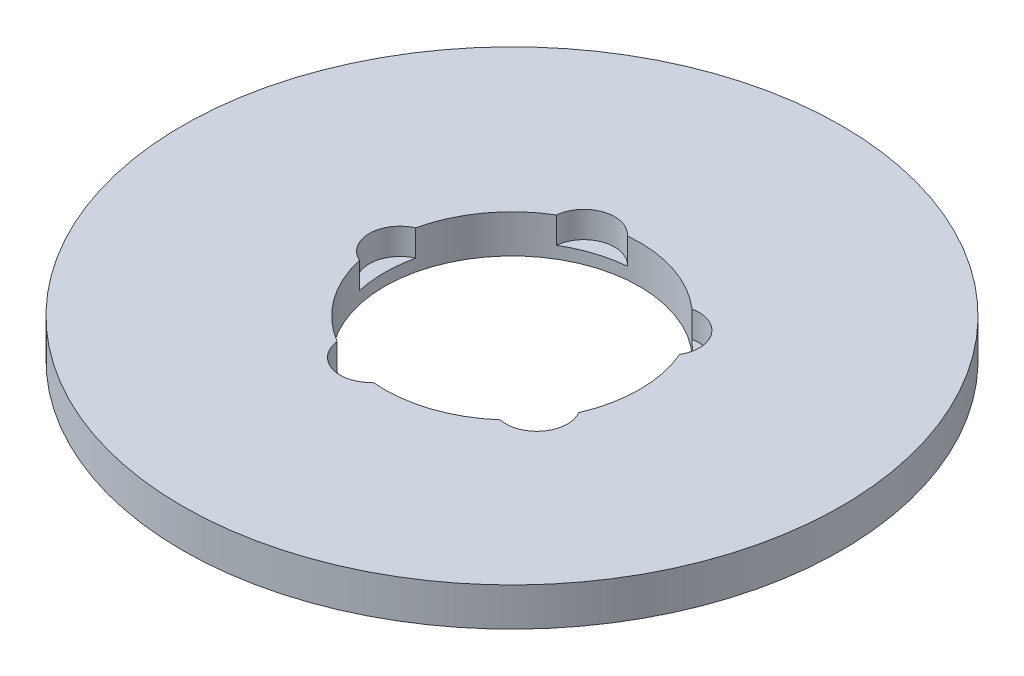
ISO-10303-21;
HEADER;
FILE_DESCRIPTION(('STEP AP214'),'2;1');
FILE_NAME('part.step','',(''),(''),'','','');
FILE_SCHEMA(('AUTOMOTIVE_DESIGN { 1 0 10303 214 1 1 1 1 }'));
ENDSEC;
DATA;
#1=APPLICATION_CONTEXT('core data for automotive mechanical design processes');
#2=APPLICATION_PROTOCOL_DEFINITION('international standard','automotive_design',2000,#1);
#3=PRODUCT_CONTEXT('',#1,'mechanical');
#4=PRODUCT('Part','Part','',(#3));
#5=PRODUCT_RELATED_PRODUCT_CATEGORY('part','',(#4));
#6=PRODUCT_DEFINITION_FORMATION('','',#4);
#7=PRODUCT_DEFINITION_CONTEXT('part definition',#1,'design');
#8=PRODUCT_DEFINITION('design','',#6,#7);
#9=PRODUCT_DEFINITION_SHAPE('','',#8);
#10=(LENGTH_UNIT() NAMED_UNIT(*) SI_UNIT(.MILLI.,.METRE.));
#11=(NAMED_UNIT(*) PLANE_ANGLE_UNIT() SI_UNIT($,.RADIAN.));
#12=(NAMED_UNIT(*) SI_UNIT($,.STERADIAN.) SOLID_ANGLE_UNIT());
#13=UNCERTAINTY_MEASURE_WITH_UNIT(LENGTH_MEASURE(1.E-05),#10,'distance_accuracy_value','');
#14=(GEOMETRIC_REPRESENTATION_CONTEXT(3) GLOBAL_UNCERTAINTY_ASSIGNED_CONTEXT((#13)) GLOBAL_UNIT_ASSIGNED_CONTEXT((#10,
#11,#12)) REPRESENTATION_CONTEXT('',''));
#15=CARTESIAN_POINT('',(0.,0.,0.));
#16=DIRECTION('',(0.,0.,1.));
#17=DIRECTION('',(1.,0.,0.));
#18=AXIS2_PLACEMENT_3D('',#15,#16,#17);
#19=CARTESIAN_POINT('',(0.,9.,0.));
#20=DIRECTION('',(0.,-1.,0.));
#21=DIRECTION('',(0.,0.,-1.));
#22=AXIS2_PLACEMENT_3D('',#19,#20,#21);
#23=CYLINDRICAL_SURFACE('',#22,77.5);
#24=CARTESIAN_POINT('',(0.,9.,0.));
#25=DIRECTION('',(0.,1.,0.));
#26=DIRECTION('',(0.,0.,1.));
#27=AXIS2_PLACEMENT_3D('',#24,#25,#26);
#28=CIRCLE('',#27,77.5);
#29=CARTESIAN_POINT('',(0.,9.,77.5));
#30=VERTEX_POINT('',#29);
#31=EDGE_CURVE('E151',#30,#30,#28,.T.);
#32=ORIENTED_EDGE('',*,*,#31,.F.);
#33=EDGE_LOOP('',(#32));
#34=FACE_BOUND('',#33,.T.);
#35=CARTESIAN_POINT('',(0.,0.,0.));
#36=DIRECTION('',(0.,1.,0.));
#37=DIRECTION('',(0.,0.,1.));
#38=AXIS2_PLACEMENT_3D('',#35,#36,#37);
#39=CIRCLE('',#38,77.5);
#40=CARTESIAN_POINT('',(0.,0.,77.5));
#41=VERTEX_POINT('',#40);
#42=EDGE_CURVE('E150',#41,#41,#39,.T.);
#43=ORIENTED_EDGE('',*,*,#42,.T.);
#44=EDGE_LOOP('',(#43));
#45=FACE_BOUND('',#44,.T.);
#46=ADVANCED_FACE('F39',(#34,#45),#23,.T.);
#47=CARTESIAN_POINT('',(0.,9.,0.));
#48=DIRECTION('',(0.,1.,0.));
#49=DIRECTION('',(0.,0.,1.));
#50=AXIS2_PLACEMENT_3D('',#47,#48,#49);
#51=PLANE('',#50);
#52=CARTESIAN_POINT('',(-8.13950397040339,9.,-25.0508173704822));
#53=DIRECTION('',(0.,1.,0.));
#54=DIRECTION('',(-0.95105651629515,0.,0.309016994374958));
#55=AXIS2_PLACEMENT_3D('',#52,#53,#54);
#56=CIRCLE('',#55,7.22711089251611);
#57=CARTESIAN_POINT('',(-2.75649534569971,9.,-29.8730938037749));
#58=VERTEX_POINT('',#57);
#59=CARTESIAN_POINT('',(-15.3289123986226,9.,-25.7880678740256));
#60=VERTEX_POINT('',#59);
#61=EDGE_CURVE('E196',#58,#60,#56,.T.);
#62=ORIENTED_EDGE('',*,*,#61,.F.);
#63=CARTESIAN_POINT('',(0.,9.,0.));
#64=DIRECTION('',(0.,1.,0.));
#65=DIRECTION('',(0.,0.,1.));
#66=AXIS2_PLACEMENT_3D('',#63,#64,#65);
#67=CIRCLE('',#66,30.);
#68=CARTESIAN_POINT('',(19.7890155577946,9.,-22.5476132495961));
#69=VERTEX_POINT('',#68);
#70=EDGE_CURVE('E156',#69,#58,#67,.T.);
#71=ORIENTED_EDGE('',*,*,#70,.F.);
#72=CARTESIAN_POINT('',(21.3094980460799,9.,-15.4822565809245));
#73=DIRECTION('',(0.,1.,0.));
#74=DIRECTION('',(-0.58778525229248,0.,-0.809016994374942));
#75=AXIS2_PLACEMENT_3D('',#72,#73,#74);
#76=CIRCLE('',#75,7.22711089251611);
#77=CARTESIAN_POINT('',(27.5591966172399,9.,-11.8528765205883));
#78=VERTEX_POINT('',#77);
#79=EDGE_CURVE('E254',#78,#69,#76,.T.);
#80=ORIENTED_EDGE('',*,*,#79,.F.);
#81=CARTESIAN_POINT('',(27.5591966172401,9.,11.8528765205879));
#82=VERTEX_POINT('',#81);
#83=EDGE_CURVE('E153',#82,#78,#67,.T.);
#84=ORIENTED_EDGE('',*,*,#83,.F.);
#85=CARTESIAN_POINT('',(21.3094980460801,9.,15.4822565809242));
#86=DIRECTION('',(0.,1.,0.));
#87=DIRECTION('',(0.587785252292469,0.,-0.809016994374951));
#88=AXIS2_PLACEMENT_3D('',#85,#86,#87);
#89=CIRCLE('',#88,7.22711089251611);
#90=CARTESIAN_POINT('',(19.7890155577949,9.,22.5476132495958));
#91=VERTEX_POINT('',#90);
#92=EDGE_CURVE('E248',#91,#82,#89,.T.);
#93=ORIENTED_EDGE('',*,*,#92,.F.);
#94=CARTESIAN_POINT('',(-2.75649534569929,9.,29.873093803775));
#95=VERTEX_POINT('',#94);
#96=EDGE_CURVE('E140',#95,#91,#67,.T.);
#97=ORIENTED_EDGE('',*,*,#96,.F.);
#98=CARTESIAN_POINT('',(-8.13950397040303,9.,25.0508173704823));
#99=DIRECTION('',(0.,1.,0.));
#100=DIRECTION('',(0.951056516295155,0.,0.309016994374945));
#101=AXIS2_PLACEMENT_3D('',#98,#99,#100);
#102=CIRCLE('',#101,7.22711089251611);
#103=CARTESIAN_POINT('',(-15.3289123986223,9.,25.7880678740259));
#104=VERTEX_POINT('',#103);
#105=EDGE_CURVE('E117',#104,#95,#102,.T.);
#106=ORIENTED_EDGE('',*,*,#105,.F.);
#107=CARTESIAN_POINT('',(-29.2628044307131,9.,6.60971079925875));
#108=VERTEX_POINT('',#107);
#109=EDGE_CURVE('E133',#108,#104,#67,.T.);
#110=ORIENTED_EDGE('',*,*,#109,.F.);
#111=CARTESIAN_POINT('',(-26.3399881513539,9.,0.));
#112=DIRECTION('',(0.,1.,0.));
#113=DIRECTION('',(0.,0.,1.));
#114=AXIS2_PLACEMENT_3D('',#111,#112,#113);
#115=CIRCLE('',#114,7.22711089251611);
#116=CARTESIAN_POINT('',(-29.2628044307131,9.,-6.60971079925875));
#117=VERTEX_POINT('',#116);
#118=EDGE_CURVE('E170',#117,#108,#115,.T.);
#119=ORIENTED_EDGE('',*,*,#118,.F.);
#120=EDGE_CURVE('E149',#60,#117,#67,.T.);
#121=ORIENTED_EDGE('',*,*,#120,.F.);
#122=EDGE_LOOP('',(#62,#71,#80,#84,#93,#97,#106,#110,#119,#121));
#123=FACE_BOUND('',#122,.T.);
#124=ORIENTED_EDGE('',*,*,#31,.T.);
#125=EDGE_LOOP('',(#124));
#126=FACE_BOUND('',#125,.T.);
#127=ADVANCED_FACE('F131',(#123,#126),#51,.T.);
#128=CARTESIAN_POINT('',(0.,0.,0.));
#129=DIRECTION('',(0.,1.,0.));
#130=DIRECTION('',(0.,0.,1.));
#131=AXIS2_PLACEMENT_3D('',#128,#129,#130);
#132=PLANE('',#131);
#133=CARTESIAN_POINT('',(0.,0.,0.));
#134=DIRECTION('',(0.,1.,0.));
#135=DIRECTION('',(0.,0.,1.));
#136=AXIS2_PLACEMENT_3D('',#133,#134,#135);
#137=CIRCLE('',#136,30.);
#138=CARTESIAN_POINT('',(0.,0.,30.));
#139=VERTEX_POINT('',#138);
#140=EDGE_CURVE('E160',#139,#139,#137,.T.);
#141=ORIENTED_EDGE('',*,*,#140,.T.);
#142=EDGE_LOOP('',(#141));
#143=FACE_BOUND('',#142,.T.);
#144=ORIENTED_EDGE('',*,*,#42,.F.);
#145=EDGE_LOOP('',(#144));
#146=FACE_BOUND('',#145,.T.);
#147=ADVANCED_FACE('F212',(#143,#146),#132,.F.);
#148=CARTESIAN_POINT('',(0.,9.,0.));
#149=DIRECTION('',(0.,-1.,0.));
#150=DIRECTION('',(0.,0.,-1.));
#151=AXIS2_PLACEMENT_3D('',#148,#149,#150);
#152=CYLINDRICAL_SURFACE('',#151,30.);
#153=DIRECTION('',(0.,1.,0.));
#154=VECTOR('',#153,1.);
#155=CARTESIAN_POINT('',(-2.75649534569971,5.91260690637871,-29.8730938037749));
#156=LINE('',#155,#154);
#157=CARTESIAN_POINT('',(-2.75649534569971,2.82521381275742,-29.8730938037749));
#158=VERTEX_POINT('',#157);
#159=EDGE_CURVE('E11',#158,#58,#156,.T.);
#160=ORIENTED_EDGE('',*,*,#159,.F.);
#161=CARTESIAN_POINT('',(0.,2.82521381275742,0.));
#162=DIRECTION('',(0.,1.,0.));
#163=DIRECTION('',(0.,0.,1.));
#164=AXIS2_PLACEMENT_3D('',#161,#162,#163);
#165=CIRCLE('',#164,30.);
#166=CARTESIAN_POINT('',(-15.3289123986226,2.82521381275742,-25.7880678740256));
#167=VERTEX_POINT('',#166);
#168=EDGE_CURVE('E193',#158,#167,#165,.T.);
#169=ORIENTED_EDGE('',*,*,#168,.T.);
#170=DIRECTION('',(0.,1.,0.));
#171=VECTOR('',#170,1.);
#172=CARTESIAN_POINT('',(-15.3289123986226,5.91260690637871,-25.7880678740256));
#173=LINE('',#172,#171);
#174=EDGE_CURVE('E46',#60,#167,#173,.F.);
#175=ORIENTED_EDGE('',*,*,#174,.F.);
#176=ORIENTED_EDGE('',*,*,#120,.T.);
#177=DIRECTION('',(0.,1.,0.));
#178=VECTOR('',#177,1.);
#179=CARTESIAN_POINT('',(-29.2628044307131,5.91260690637871,-6.60971079925875));
#180=LINE('',#179,#178);
#181=CARTESIAN_POINT('',(-29.2628044307131,2.82521381275742,-6.60971079925875));
#182=VERTEX_POINT('',#181);
#183=EDGE_CURVE('E174',#182,#117,#180,.T.);
#184=ORIENTED_EDGE('',*,*,#183,.F.);
#185=CARTESIAN_POINT('',(0.,2.82521381275742,0.));
#186=DIRECTION('',(0.,1.,0.));
#187=DIRECTION('',(0.,0.,1.));
#188=AXIS2_PLACEMENT_3D('',#185,#186,#187);
#189=CIRCLE('',#188,30.);
#190=CARTESIAN_POINT('',(-29.2628044307131,2.82521381275742,6.60971079925875));
#191=VERTEX_POINT('',#190);
#192=EDGE_CURVE('E171',#182,#191,#189,.T.);
#193=ORIENTED_EDGE('',*,*,#192,.T.);
#194=DIRECTION('',(0.,1.,0.));
#195=VECTOR('',#194,1.);
#196=CARTESIAN_POINT('',(-29.2628044307131,5.91260690637871,6.60971079925875));
#197=LINE('',#196,#195);
#198=EDGE_CURVE('E148',#108,#191,#197,.F.);
#199=ORIENTED_EDGE('',*,*,#198,.F.);
#200=ORIENTED_EDGE('',*,*,#109,.T.);
#201=DIRECTION('',(0.,1.,0.));
#202=VECTOR('',#201,1.);
#203=CARTESIAN_POINT('',(-15.3289123986223,5.91260690637871,25.7880678740259));
#204=LINE('',#203,#202);
#205=CARTESIAN_POINT('',(-15.3289123986223,2.82521381275742,25.7880678740259));
#206=VERTEX_POINT('',#205);
#207=EDGE_CURVE('E111',#206,#104,#204,.T.);
#208=ORIENTED_EDGE('',*,*,#207,.F.);
#209=CARTESIAN_POINT('',(0.,2.82521381275742,0.));
#210=DIRECTION('',(0.,1.,0.));
#211=DIRECTION('',(0.,0.,1.));
#212=AXIS2_PLACEMENT_3D('',#209,#210,#211);
#213=CIRCLE('',#212,30.);
#214=CARTESIAN_POINT('',(-2.75649534569929,2.82521381275742,29.873093803775));
#215=VERTEX_POINT('',#214);
#216=EDGE_CURVE('E180',#206,#215,#213,.T.);
#217=ORIENTED_EDGE('',*,*,#216,.T.);
#218=DIRECTION('',(0.,1.,0.));
#219=VECTOR('',#218,1.);
#220=CARTESIAN_POINT('',(-2.75649534569929,5.91260690637871,29.873093803775));
#221=LINE('',#220,#219);
#222=EDGE_CURVE('E124',#95,#215,#221,.F.);
#223=ORIENTED_EDGE('',*,*,#222,.F.);
#224=ORIENTED_EDGE('',*,*,#96,.T.);
#225=DIRECTION('',(0.,1.,0.));
#226=VECTOR('',#225,1.);
#227=CARTESIAN_POINT('',(19.7890155577949,5.91260690637871,22.5476132495958));
#228=LINE('',#227,#226);
#229=CARTESIAN_POINT('',(19.7890155577949,2.82521381275742,22.5476132495958));
#230=VERTEX_POINT('',#229);
#231=EDGE_CURVE('E183',#230,#91,#228,.T.);
#232=ORIENTED_EDGE('',*,*,#231,.F.);
#233=CARTESIAN_POINT('',(0.,2.82521381275742,0.));
#234=DIRECTION('',(0.,1.,0.));
#235=DIRECTION('',(0.,0.,1.));
#236=AXIS2_PLACEMENT_3D('',#233,#234,#235);
#237=CIRCLE('',#236,30.);
#238=CARTESIAN_POINT('',(27.5591966172401,2.82521381275742,11.8528765205879));
#239=VERTEX_POINT('',#238);
#240=EDGE_CURVE('E123',#230,#239,#237,.T.);
#241=ORIENTED_EDGE('',*,*,#240,.T.);
#242=DIRECTION('',(0.,1.,0.));
#243=VECTOR('',#242,1.);
#244=CARTESIAN_POINT('',(27.5591966172401,5.91260690637871,11.8528765205879));
#245=LINE('',#244,#243);
#246=EDGE_CURVE('E185',#82,#239,#245,.F.);
#247=ORIENTED_EDGE('',*,*,#246,.F.);
#248=ORIENTED_EDGE('',*,*,#83,.T.);
#249=DIRECTION('',(0.,1.,0.));
#250=VECTOR('',#249,1.);
#251=CARTESIAN_POINT('',(27.5591966172399,5.91260690637871,-11.8528765205883));
#252=LINE('',#251,#250);
#253=CARTESIAN_POINT('',(27.5591966172399,2.82521381275742,-11.8528765205883));
#254=VERTEX_POINT('',#253);
#255=EDGE_CURVE('E195',#254,#78,#252,.T.);
#256=ORIENTED_EDGE('',*,*,#255,.F.);
#257=CARTESIAN_POINT('',(0.,2.82521381275742,0.));
#258=DIRECTION('',(0.,1.,0.));
#259=DIRECTION('',(0.,0.,1.));
#260=AXIS2_PLACEMENT_3D('',#257,#258,#259);
#261=CIRCLE('',#260,30.);
#262=CARTESIAN_POINT('',(19.7890155577946,2.82521381275742,-22.5476132495961));
#263=VERTEX_POINT('',#262);
#264=EDGE_CURVE('E190',#254,#263,#261,.T.);
#265=ORIENTED_EDGE('',*,*,#264,.T.);
#266=DIRECTION('',(0.,1.,0.));
#267=VECTOR('',#266,1.);
#268=CARTESIAN_POINT('',(19.7890155577946,5.91260690637871,-22.5476132495961));
#269=LINE('',#268,#267);
#270=EDGE_CURVE('E189',#69,#263,#269,.F.);
#271=ORIENTED_EDGE('',*,*,#270,.F.);
#272=ORIENTED_EDGE('',*,*,#70,.T.);
#273=EDGE_LOOP('',(#160,#169,#175,#176,#184,#193,#199,#200,#208,#217,#223,#224,#232,#241,#247,
#248,#256,#265,#271,#272));
#274=FACE_BOUND('',#273,.T.);
#275=ORIENTED_EDGE('',*,*,#140,.F.);
#276=EDGE_LOOP('',(#275));
#277=FACE_BOUND('',#276,.T.);
#278=ADVANCED_FACE('F142',(#274,#277),#152,.F.);
#279=CARTESIAN_POINT('',(-26.3399881513539,2.82521381275742,0.));
#280=DIRECTION('',(0.,1.,0.));
#281=DIRECTION('',(0.,0.,1.));
#282=AXIS2_PLACEMENT_3D('',#279,#280,#281);
#283=CYLINDRICAL_SURFACE('',#282,7.22711089251611);
#284=ORIENTED_EDGE('',*,*,#183,.T.);
#285=ORIENTED_EDGE('',*,*,#118,.T.);
#286=ORIENTED_EDGE('',*,*,#198,.T.);
#287=CARTESIAN_POINT('',(-26.3399881513539,2.82521381275742,0.));
#288=DIRECTION('',(0.,1.,0.));
#289=DIRECTION('',(0.,0.,1.));
#290=AXIS2_PLACEMENT_3D('',#287,#288,#289);
#291=CIRCLE('',#290,7.22711089251611);
#292=EDGE_CURVE('E163',#182,#191,#291,.T.);
#293=ORIENTED_EDGE('',*,*,#292,.F.);
#294=EDGE_LOOP('',(#284,#285,#286,#293));
#295=FACE_BOUND('',#294,.T.);
#296=ADVANCED_FACE('F221',(#295),#283,.F.);
#297=CARTESIAN_POINT('',(-26.3399881513539,2.82521381275742,0.));
#298=DIRECTION('',(0.,1.,0.));
#299=DIRECTION('',(0.,0.,1.));
#300=AXIS2_PLACEMENT_3D('',#297,#298,#299);
#301=PLANE('',#300);
#302=ORIENTED_EDGE('',*,*,#292,.T.);
#303=ORIENTED_EDGE('',*,*,#192,.F.);
#304=EDGE_LOOP('',(#302,#303));
#305=FACE_BOUND('',#304,.T.);
#306=ADVANCED_FACE('F227',(#305),#301,.T.);
#307=CARTESIAN_POINT('',(-8.13950397040303,2.82521381275742,25.0508173704823));
#308=DIRECTION('',(0.,1.,0.));
#309=DIRECTION('',(0.,0.,1.));
#310=AXIS2_PLACEMENT_3D('',#307,#308,#309);
#311=CYLINDRICAL_SURFACE('',#310,7.22711089251611);
#312=ORIENTED_EDGE('',*,*,#207,.T.);
#313=ORIENTED_EDGE('',*,*,#105,.T.);
#314=ORIENTED_EDGE('',*,*,#222,.T.);
#315=CARTESIAN_POINT('',(-8.13950397040303,2.82521381275742,25.0508173704823));
#316=DIRECTION('',(0.,1.,0.));
#317=DIRECTION('',(0.951056516295155,0.,0.309016994374945));
#318=AXIS2_PLACEMENT_3D('',#315,#316,#317);
#319=CIRCLE('',#318,7.22711089251611);
#320=EDGE_CURVE('E119',#206,#215,#319,.T.);
#321=ORIENTED_EDGE('',*,*,#320,.F.);
#322=EDGE_LOOP('',(#312,#313,#314,#321));
#323=FACE_BOUND('',#322,.T.);
#324=ADVANCED_FACE('F116',(#323),#311,.F.);
#325=CARTESIAN_POINT('',(-8.13950397040303,2.82521381275742,25.0508173704823));
#326=DIRECTION('',(0.,1.,0.));
#327=DIRECTION('',(0.951056516295155,0.,0.309016994374945));
#328=AXIS2_PLACEMENT_3D('',#325,#326,#327);
#329=PLANE('',#328);
#330=ORIENTED_EDGE('',*,*,#320,.T.);
#331=ORIENTED_EDGE('',*,*,#216,.F.);
#332=EDGE_LOOP('',(#330,#331));
#333=FACE_BOUND('',#332,.T.);
#334=ADVANCED_FACE('F234',(#333),#329,.T.);
#335=CARTESIAN_POINT('',(21.3094980460801,2.82521381275742,15.4822565809242));
#336=DIRECTION('',(0.,1.,0.));
#337=DIRECTION('',(0.,0.,1.));
#338=AXIS2_PLACEMENT_3D('',#335,#336,#337);
#339=CYLINDRICAL_SURFACE('',#338,7.22711089251611);
#340=ORIENTED_EDGE('',*,*,#231,.T.);
#341=ORIENTED_EDGE('',*,*,#92,.T.);
#342=ORIENTED_EDGE('',*,*,#246,.T.);
#343=CARTESIAN_POINT('',(21.3094980460801,2.82521381275742,15.4822565809242));
#344=DIRECTION('',(0.,1.,0.));
#345=DIRECTION('',(0.587785252292469,0.,-0.809016994374951));
#346=AXIS2_PLACEMENT_3D('',#343,#344,#345);
#347=CIRCLE('',#346,7.22711089251611);
#348=EDGE_CURVE('E137',#230,#239,#347,.T.);
#349=ORIENTED_EDGE('',*,*,#348,.F.);
#350=EDGE_LOOP('',(#340,#341,#342,#349));
#351=FACE_BOUND('',#350,.T.);
#352=ADVANCED_FACE('F240',(#351),#339,.F.);
#353=CARTESIAN_POINT('',(21.3094980460801,2.82521381275742,15.4822565809242));
#354=DIRECTION('',(0.,1.,0.));
#355=DIRECTION('',(0.587785252292469,0.,-0.809016994374951));
#356=AXIS2_PLACEMENT_3D('',#353,#354,#355);
#357=PLANE('',#356);
#358=ORIENTED_EDGE('',*,*,#348,.T.);
#359=ORIENTED_EDGE('',*,*,#240,.F.);
#360=EDGE_LOOP('',(#358,#359));
#361=FACE_BOUND('',#360,.T.);
#362=ADVANCED_FACE('F245',(#361),#357,.T.);
#363=CARTESIAN_POINT('',(21.3094980460799,2.82521381275742,-15.4822565809245));
#364=DIRECTION('',(0.,1.,0.));
#365=DIRECTION('',(0.,0.,1.));
#366=AXIS2_PLACEMENT_3D('',#363,#364,#365);
#367=CYLINDRICAL_SURFACE('',#366,7.22711089251611);
#368=ORIENTED_EDGE('',*,*,#255,.T.);
#369=ORIENTED_EDGE('',*,*,#79,.T.);
#370=ORIENTED_EDGE('',*,*,#270,.T.);
#371=CARTESIAN_POINT('',(21.3094980460799,2.82521381275742,-15.4822565809245));
#372=DIRECTION('',(0.,1.,0.));
#373=DIRECTION('',(-0.58778525229248,0.,-0.809016994374942));
#374=AXIS2_PLACEMENT_3D('',#371,#372,#373);
#375=CIRCLE('',#374,7.22711089251611);
#376=EDGE_CURVE('E56',#254,#263,#375,.T.);
#377=ORIENTED_EDGE('',*,*,#376,.F.);
#378=EDGE_LOOP('',(#368,#369,#370,#377));
#379=FACE_BOUND('',#378,.T.);
#380=ADVANCED_FACE('F264',(#379),#367,.F.);
#381=CARTESIAN_POINT('',(21.3094980460799,2.82521381275742,-15.4822565809245));
#382=DIRECTION('',(0.,1.,0.));
#383=DIRECTION('',(-0.58778525229248,0.,-0.809016994374942));
#384=AXIS2_PLACEMENT_3D('',#381,#382,#383);
#385=PLANE('',#384);
#386=ORIENTED_EDGE('',*,*,#376,.T.);
#387=ORIENTED_EDGE('',*,*,#264,.F.);
#388=EDGE_LOOP('',(#386,#387));
#389=FACE_BOUND('',#388,.T.);
#390=ADVANCED_FACE('F202',(#389),#385,.T.);
#391=CARTESIAN_POINT('',(-8.13950397040339,2.82521381275742,-25.0508173704822));
#392=DIRECTION('',(0.,1.,0.));
#393=DIRECTION('',(0.,0.,1.));
#394=AXIS2_PLACEMENT_3D('',#391,#392,#393);
#395=CYLINDRICAL_SURFACE('',#394,7.22711089251611);
#396=ORIENTED_EDGE('',*,*,#159,.T.);
#397=ORIENTED_EDGE('',*,*,#61,.T.);
#398=ORIENTED_EDGE('',*,*,#174,.T.);
#399=CARTESIAN_POINT('',(-8.13950397040339,2.82521381275742,-25.0508173704822));
#400=DIRECTION('',(0.,1.,0.));
#401=DIRECTION('',(-0.95105651629515,0.,0.309016994374958));
#402=AXIS2_PLACEMENT_3D('',#399,#400,#401);
#403=CIRCLE('',#402,7.22711089251611);
#404=EDGE_CURVE('E55',#158,#167,#403,.T.);
#405=ORIENTED_EDGE('',*,*,#404,.F.);
#406=EDGE_LOOP('',(#396,#397,#398,#405));
#407=FACE_BOUND('',#406,.T.);
#408=ADVANCED_FACE('F197',(#407),#395,.F.);
#409=CARTESIAN_POINT('',(-8.13950397040339,2.82521381275742,-25.0508173704822));
#410=DIRECTION('',(0.,1.,0.));
#411=DIRECTION('',(-0.95105651629515,0.,0.309016994374958));
#412=AXIS2_PLACEMENT_3D('',#409,#410,#411);
#413=PLANE('',#412);
#414=ORIENTED_EDGE('',*,*,#404,.T.);
#415=ORIENTED_EDGE('',*,*,#168,.F.);
#416=EDGE_LOOP('',(#414,#415));
#417=FACE_BOUND('',#416,.T.);
#418=ADVANCED_FACE('F200',(#417),#413,.T.);
#419=CLOSED_SHELL('',(#46,#127,#147,#278,#296,#306,#324,#334,#352,#362,#380,#390,#408,#418));
#420=MANIFOLD_SOLID_BREP('B2',#419);
#421=ADVANCED_BREP_SHAPE_REPRESENTATION('',(#18,#420),#14);
#422=SHAPE_DEFINITION_REPRESENTATION(#9,#421);
ENDSEC;
END-ISO-10303-21;
